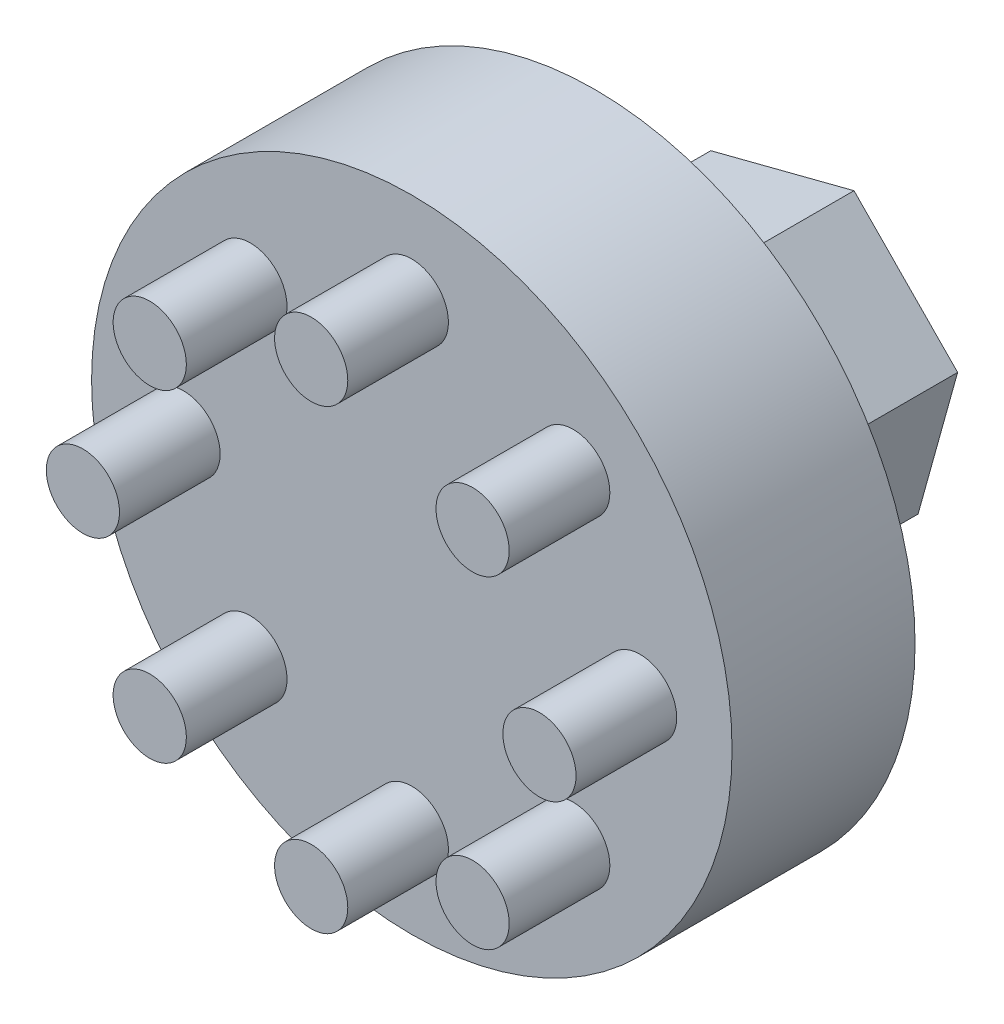
ISO-10303-21;
HEADER;
FILE_DESCRIPTION(('STEP AP214'),'2;1');
FILE_NAME('part.step','',(''),(''),'','','');
FILE_SCHEMA(('AUTOMOTIVE_DESIGN { 1 0 10303 214 1 1 1 1 }'));
ENDSEC;
DATA;
#1=APPLICATION_CONTEXT('core data for automotive mechanical design processes');
#2=APPLICATION_PROTOCOL_DEFINITION('international standard','automotive_design',2000,#1);
#3=PRODUCT_CONTEXT('',#1,'mechanical');
#4=PRODUCT('Part','Part','',(#3));
#5=PRODUCT_RELATED_PRODUCT_CATEGORY('part','',(#4));
#6=PRODUCT_DEFINITION_FORMATION('','',#4);
#7=PRODUCT_DEFINITION_CONTEXT('part definition',#1,'design');
#8=PRODUCT_DEFINITION('design','',#6,#7);
#9=PRODUCT_DEFINITION_SHAPE('','',#8);
#10=(LENGTH_UNIT() NAMED_UNIT(*) SI_UNIT(.MILLI.,.METRE.));
#11=(NAMED_UNIT(*) PLANE_ANGLE_UNIT() SI_UNIT($,.RADIAN.));
#12=(NAMED_UNIT(*) SI_UNIT($,.STERADIAN.) SOLID_ANGLE_UNIT());
#13=UNCERTAINTY_MEASURE_WITH_UNIT(LENGTH_MEASURE(1.E-05),#10,'distance_accuracy_value','');
#14=(GEOMETRIC_REPRESENTATION_CONTEXT(3) GLOBAL_UNCERTAINTY_ASSIGNED_CONTEXT((#13)) GLOBAL_UNIT_ASSIGNED_CONTEXT((#10,
#11,#12)) REPRESENTATION_CONTEXT('',''));
#15=CARTESIAN_POINT('',(0.,0.,0.));
#16=DIRECTION('',(0.,0.,1.));
#17=DIRECTION('',(1.,0.,0.));
#18=AXIS2_PLACEMENT_3D('',#15,#16,#17);
#19=CARTESIAN_POINT('',(0.,0.,0.));
#20=DIRECTION('',(0.,0.,1.));
#21=DIRECTION('',(1.,0.,0.));
#22=AXIS2_PLACEMENT_3D('',#19,#20,#21);
#23=PLANE('',#22);
#24=CARTESIAN_POINT('',(0.,0.,0.));
#25=DIRECTION('',(0.,0.,1.));
#26=DIRECTION('',(1.,0.,0.));
#27=AXIS2_PLACEMENT_3D('',#24,#25,#26);
#28=CIRCLE('',#27,17.5);
#29=CARTESIAN_POINT('',(17.5,0.,0.));
#30=VERTEX_POINT('',#29);
#31=EDGE_CURVE('E48',#30,#30,#28,.T.);
#32=ORIENTED_EDGE('',*,*,#31,.F.);
#33=EDGE_LOOP('',(#32));
#34=FACE_BOUND('',#33,.T.);
#35=DIRECTION('',(0.267671004992272,0.963510369994235,0.));
#36=VECTOR('',#35,1.);
#37=CARTESIAN_POINT('',(-7.82635207746546,-2.02028376543627,0.));
#38=LINE('',#37,#36);
#39=CARTESIAN_POINT('',(-7.82635207746546,-2.02028376543627,0.));
#40=VERTEX_POINT('',#39);
#41=CARTESIAN_POINT('',(-5.66279310245382,5.76767783532808,0.));
#42=VERTEX_POINT('',#41);
#43=EDGE_CURVE('E117',#40,#42,#38,.T.);
#44=ORIENTED_EDGE('',*,*,#43,.F.);
#45=DIRECTION('',(-0.700588954728615,0.713565075176936,0.));
#46=VECTOR('',#45,1.);
#47=CARTESIAN_POINT('',(-2.16355897501164,-7.78796160076434,0.));
#48=LINE('',#47,#46);
#49=CARTESIAN_POINT('',(-2.16355897501165,-7.78796160076434,0.));
#50=VERTEX_POINT('',#49);
#51=EDGE_CURVE('E114',#50,#40,#48,.T.);
#52=ORIENTED_EDGE('',*,*,#51,.F.);
#53=DIRECTION('',(-0.968259959720887,-0.249945294817299,0.));
#54=VECTOR('',#53,1.);
#55=CARTESIAN_POINT('',(5.66279310245382,-5.76767783532807,0.));
#56=LINE('',#55,#54);
#57=CARTESIAN_POINT('',(5.66279310245382,-5.76767783532807,0.));
#58=VERTEX_POINT('',#57);
#59=EDGE_CURVE('E196',#58,#50,#56,.T.);
#60=ORIENTED_EDGE('',*,*,#59,.F.);
#61=DIRECTION('',(-0.267671004992272,-0.963510369994235,0.));
#62=VECTOR('',#61,1.);
#63=CARTESIAN_POINT('',(7.82635207746547,2.02028376543627,0.));
#64=LINE('',#63,#62);
#65=CARTESIAN_POINT('',(7.82635207746547,2.02028376543627,0.));
#66=VERTEX_POINT('',#65);
#67=EDGE_CURVE('E213',#66,#58,#64,.T.);
#68=ORIENTED_EDGE('',*,*,#67,.F.);
#69=DIRECTION('',(0.700588954728615,-0.713565075176936,0.));
#70=VECTOR('',#69,1.);
#71=CARTESIAN_POINT('',(2.16355897501164,7.78796160076434,0.));
#72=LINE('',#71,#70);
#73=CARTESIAN_POINT('',(2.16355897501164,7.78796160076434,0.));
#74=VERTEX_POINT('',#73);
#75=EDGE_CURVE('E64',#74,#66,#72,.T.);
#76=ORIENTED_EDGE('',*,*,#75,.F.);
#77=DIRECTION('',(0.968259959720887,0.249945294817298,0.));
#78=VECTOR('',#77,1.);
#79=CARTESIAN_POINT('',(-5.66279310245382,5.76767783532808,0.));
#80=LINE('',#79,#78);
#81=EDGE_CURVE('E59',#42,#74,#80,.T.);
#82=ORIENTED_EDGE('',*,*,#81,.F.);
#83=EDGE_LOOP('',(#44,#52,#60,#68,#76,#82));
#84=FACE_BOUND('',#83,.T.);
#85=ADVANCED_FACE('F44',(#34,#84),#23,.F.);
#86=CARTESIAN_POINT('',(0.,0.,10.));
#87=DIRECTION('',(0.,0.,-1.));
#88=DIRECTION('',(-1.,0.,0.));
#89=AXIS2_PLACEMENT_3D('',#86,#87,#88);
#90=CYLINDRICAL_SURFACE('',#89,17.5);
#91=CARTESIAN_POINT('',(0.,0.,10.));
#92=DIRECTION('',(0.,0.,1.));
#93=DIRECTION('',(1.,0.,0.));
#94=AXIS2_PLACEMENT_3D('',#91,#92,#93);
#95=CIRCLE('',#94,17.5);
#96=CARTESIAN_POINT('',(17.5,0.,10.));
#97=VERTEX_POINT('',#96);
#98=EDGE_CURVE('E13',#97,#97,#95,.T.);
#99=ORIENTED_EDGE('',*,*,#98,.F.);
#100=EDGE_LOOP('',(#99));
#101=FACE_BOUND('',#100,.T.);
#102=ORIENTED_EDGE('',*,*,#31,.T.);
#103=EDGE_LOOP('',(#102));
#104=FACE_BOUND('',#103,.T.);
#105=ADVANCED_FACE('F46',(#101,#104),#90,.T.);
#106=CARTESIAN_POINT('',(0.,0.,10.));
#107=DIRECTION('',(0.,0.,1.));
#108=DIRECTION('',(1.,0.,0.));
#109=AXIS2_PLACEMENT_3D('',#106,#107,#108);
#110=PLANE('',#109);
#111=CARTESIAN_POINT('',(-8.82115709530209,8.82115709530196,10.));
#112=DIRECTION('',(0.,0.,1.));
#113=DIRECTION('',(1.,0.,0.));
#114=AXIS2_PLACEMENT_3D('',#111,#112,#113);
#115=CIRCLE('',#114,2.);
#116=CARTESIAN_POINT('',(-6.82115709530209,8.82115709530196,10.));
#117=VERTEX_POINT('',#116);
#118=EDGE_CURVE('E118',#117,#117,#115,.T.);
#119=ORIENTED_EDGE('',*,*,#118,.F.);
#120=EDGE_LOOP('',(#119));
#121=FACE_BOUND('',#120,.T.);
#122=CARTESIAN_POINT('',(-12.4749999999997,-3.10857854469547E-13,10.));
#123=DIRECTION('',(0.,0.,1.));
#124=DIRECTION('',(1.,0.,0.));
#125=AXIS2_PLACEMENT_3D('',#122,#123,#124);
#126=CIRCLE('',#125,2.);
#127=CARTESIAN_POINT('',(-10.4749999999997,-3.10857854469547E-13,10.));
#128=VERTEX_POINT('',#127);
#129=EDGE_CURVE('E128',#128,#128,#126,.T.);
#130=ORIENTED_EDGE('',*,*,#129,.F.);
#131=EDGE_LOOP('',(#130));
#132=FACE_BOUND('',#131,.T.);
#133=CARTESIAN_POINT('',(-8.82115709530165,-8.8211570953024,10.));
#134=DIRECTION('',(0.,0.,1.));
#135=DIRECTION('',(1.,0.,0.));
#136=AXIS2_PLACEMENT_3D('',#133,#134,#135);
#137=CIRCLE('',#136,2.);
#138=CARTESIAN_POINT('',(-6.82115709530165,-8.8211570953024,10.));
#139=VERTEX_POINT('',#138);
#140=EDGE_CURVE('E133',#139,#139,#137,.T.);
#141=ORIENTED_EDGE('',*,*,#140,.F.);
#142=EDGE_LOOP('',(#141));
#143=FACE_BOUND('',#142,.T.);
#144=CARTESIAN_POINT('',(6.18660215175221E-13,-12.475,10.));
#145=DIRECTION('',(0.,0.,1.));
#146=DIRECTION('',(1.,0.,0.));
#147=AXIS2_PLACEMENT_3D('',#144,#145,#146);
#148=CIRCLE('',#147,2.);
#149=CARTESIAN_POINT('',(2.00000000000062,-12.475,10.));
#150=VERTEX_POINT('',#149);
#151=EDGE_CURVE('E139',#150,#150,#148,.T.);
#152=ORIENTED_EDGE('',*,*,#151,.F.);
#153=EDGE_LOOP('',(#152));
#154=FACE_BOUND('',#153,.T.);
#155=CARTESIAN_POINT('',(8.82115709530271,-8.82115709530196,10.));
#156=DIRECTION('',(0.,0.,1.));
#157=DIRECTION('',(1.,0.,0.));
#158=AXIS2_PLACEMENT_3D('',#155,#156,#157);
#159=CIRCLE('',#158,2.);
#160=CARTESIAN_POINT('',(10.8211570953027,-8.82115709530196,10.));
#161=VERTEX_POINT('',#160);
#162=EDGE_CURVE('E145',#161,#161,#159,.T.);
#163=ORIENTED_EDGE('',*,*,#162,.F.);
#164=EDGE_LOOP('',(#163));
#165=FACE_BOUND('',#164,.T.);
#166=CARTESIAN_POINT('',(12.4750000000003,3.09330107587611E-13,10.));
#167=DIRECTION('',(0.,0.,1.));
#168=DIRECTION('',(1.,0.,0.));
#169=AXIS2_PLACEMENT_3D('',#166,#167,#168);
#170=CIRCLE('',#169,2.);
#171=CARTESIAN_POINT('',(14.4750000000003,3.09330107587611E-13,10.));
#172=VERTEX_POINT('',#171);
#173=EDGE_CURVE('E151',#172,#172,#170,.T.);
#174=ORIENTED_EDGE('',*,*,#173,.F.);
#175=EDGE_LOOP('',(#174));
#176=FACE_BOUND('',#175,.T.);
#177=CARTESIAN_POINT('',(8.82115709530227,8.8211570953024,10.));
#178=DIRECTION('',(0.,0.,1.));
#179=DIRECTION('',(1.,0.,0.));
#180=AXIS2_PLACEMENT_3D('',#177,#178,#179);
#181=CIRCLE('',#180,2.);
#182=CARTESIAN_POINT('',(10.8211570953023,8.8211570953024,10.));
#183=VERTEX_POINT('',#182);
#184=EDGE_CURVE('E157',#183,#183,#181,.T.);
#185=ORIENTED_EDGE('',*,*,#184,.F.);
#186=EDGE_LOOP('',(#185));
#187=FACE_BOUND('',#186,.T.);
#188=CARTESIAN_POINT('',(0.,12.475,10.));
#189=DIRECTION('',(0.,0.,1.));
#190=DIRECTION('',(1.,0.,0.));
#191=AXIS2_PLACEMENT_3D('',#188,#189,#190);
#192=CIRCLE('',#191,2.);
#193=CARTESIAN_POINT('',(2.,12.475,10.));
#194=VERTEX_POINT('',#193);
#195=EDGE_CURVE('E163',#194,#194,#192,.T.);
#196=ORIENTED_EDGE('',*,*,#195,.F.);
#197=EDGE_LOOP('',(#196));
#198=FACE_BOUND('',#197,.T.);
#199=ORIENTED_EDGE('',*,*,#98,.T.);
#200=EDGE_LOOP('',(#199));
#201=FACE_BOUND('',#200,.T.);
#202=ADVANCED_FACE('F174',(#121,#132,#143,#154,#165,#176,#187,#198,#201),#110,.T.);
#203=CARTESIAN_POINT('',(0.,12.475,15.5));
#204=DIRECTION('',(0.,0.,-1.));
#205=DIRECTION('',(-1.,0.,0.));
#206=AXIS2_PLACEMENT_3D('',#203,#204,#205);
#207=CYLINDRICAL_SURFACE('',#206,2.);
#208=CARTESIAN_POINT('',(0.,12.475,15.5));
#209=DIRECTION('',(0.,0.,1.));
#210=DIRECTION('',(1.,0.,0.));
#211=AXIS2_PLACEMENT_3D('',#208,#209,#210);
#212=CIRCLE('',#211,2.);
#213=CARTESIAN_POINT('',(2.,12.475,15.5));
#214=VERTEX_POINT('',#213);
#215=EDGE_CURVE('E166',#214,#214,#212,.T.);
#216=ORIENTED_EDGE('',*,*,#215,.F.);
#217=EDGE_LOOP('',(#216));
#218=FACE_BOUND('',#217,.T.);
#219=ORIENTED_EDGE('',*,*,#195,.T.);
#220=EDGE_LOOP('',(#219));
#221=FACE_BOUND('',#220,.T.);
#222=ADVANCED_FACE('F172',(#218,#221),#207,.T.);
#223=CARTESIAN_POINT('',(0.,12.475,15.5));
#224=DIRECTION('',(0.,0.,1.));
#225=DIRECTION('',(1.,0.,0.));
#226=AXIS2_PLACEMENT_3D('',#223,#224,#225);
#227=PLANE('',#226);
#228=ORIENTED_EDGE('',*,*,#215,.T.);
#229=EDGE_LOOP('',(#228));
#230=FACE_BOUND('',#229,.T.);
#231=ADVANCED_FACE('F297',(#230),#227,.T.);
#232=CARTESIAN_POINT('',(8.82115709530227,8.8211570953024,15.5));
#233=DIRECTION('',(0.,0.,-1.));
#234=DIRECTION('',(-1.,0.,0.));
#235=AXIS2_PLACEMENT_3D('',#232,#233,#234);
#236=CYLINDRICAL_SURFACE('',#235,2.);
#237=CARTESIAN_POINT('',(8.82115709530227,8.8211570953024,15.5));
#238=DIRECTION('',(0.,0.,1.));
#239=DIRECTION('',(1.,0.,0.));
#240=AXIS2_PLACEMENT_3D('',#237,#238,#239);
#241=CIRCLE('',#240,2.);
#242=CARTESIAN_POINT('',(10.8211570953023,8.8211570953024,15.5));
#243=VERTEX_POINT('',#242);
#244=EDGE_CURVE('E160',#243,#243,#241,.T.);
#245=ORIENTED_EDGE('',*,*,#244,.F.);
#246=EDGE_LOOP('',(#245));
#247=FACE_BOUND('',#246,.T.);
#248=ORIENTED_EDGE('',*,*,#184,.T.);
#249=EDGE_LOOP('',(#248));
#250=FACE_BOUND('',#249,.T.);
#251=ADVANCED_FACE('F293',(#247,#250),#236,.T.);
#252=CARTESIAN_POINT('',(8.82115709530227,8.8211570953024,15.5));
#253=DIRECTION('',(0.,0.,1.));
#254=DIRECTION('',(1.,0.,0.));
#255=AXIS2_PLACEMENT_3D('',#252,#253,#254);
#256=PLANE('',#255);
#257=ORIENTED_EDGE('',*,*,#244,.T.);
#258=EDGE_LOOP('',(#257));
#259=FACE_BOUND('',#258,.T.);
#260=ADVANCED_FACE('F289',(#259),#256,.T.);
#261=CARTESIAN_POINT('',(12.4750000000003,3.09330107587611E-13,15.5));
#262=DIRECTION('',(0.,0.,-1.));
#263=DIRECTION('',(-1.,0.,0.));
#264=AXIS2_PLACEMENT_3D('',#261,#262,#263);
#265=CYLINDRICAL_SURFACE('',#264,2.);
#266=CARTESIAN_POINT('',(12.4750000000003,3.09330107587611E-13,15.5));
#267=DIRECTION('',(0.,0.,1.));
#268=DIRECTION('',(1.,0.,0.));
#269=AXIS2_PLACEMENT_3D('',#266,#267,#268);
#270=CIRCLE('',#269,2.);
#271=CARTESIAN_POINT('',(14.4750000000003,3.09330107587611E-13,15.5));
#272=VERTEX_POINT('',#271);
#273=EDGE_CURVE('E154',#272,#272,#270,.T.);
#274=ORIENTED_EDGE('',*,*,#273,.F.);
#275=EDGE_LOOP('',(#274));
#276=FACE_BOUND('',#275,.T.);
#277=ORIENTED_EDGE('',*,*,#173,.T.);
#278=EDGE_LOOP('',(#277));
#279=FACE_BOUND('',#278,.T.);
#280=ADVANCED_FACE('F285',(#276,#279),#265,.T.);
#281=CARTESIAN_POINT('',(12.4750000000003,3.09330107587611E-13,15.5));
#282=DIRECTION('',(0.,0.,1.));
#283=DIRECTION('',(1.,0.,0.));
#284=AXIS2_PLACEMENT_3D('',#281,#282,#283);
#285=PLANE('',#284);
#286=ORIENTED_EDGE('',*,*,#273,.T.);
#287=EDGE_LOOP('',(#286));
#288=FACE_BOUND('',#287,.T.);
#289=ADVANCED_FACE('F281',(#288),#285,.T.);
#290=CARTESIAN_POINT('',(8.82115709530271,-8.82115709530196,15.5));
#291=DIRECTION('',(0.,0.,-1.));
#292=DIRECTION('',(-1.,0.,0.));
#293=AXIS2_PLACEMENT_3D('',#290,#291,#292);
#294=CYLINDRICAL_SURFACE('',#293,2.);
#295=CARTESIAN_POINT('',(8.82115709530271,-8.82115709530196,15.5));
#296=DIRECTION('',(0.,0.,1.));
#297=DIRECTION('',(1.,0.,0.));
#298=AXIS2_PLACEMENT_3D('',#295,#296,#297);
#299=CIRCLE('',#298,2.);
#300=CARTESIAN_POINT('',(10.8211570953027,-8.82115709530196,15.5));
#301=VERTEX_POINT('',#300);
#302=EDGE_CURVE('E148',#301,#301,#299,.T.);
#303=ORIENTED_EDGE('',*,*,#302,.F.);
#304=EDGE_LOOP('',(#303));
#305=FACE_BOUND('',#304,.T.);
#306=ORIENTED_EDGE('',*,*,#162,.T.);
#307=EDGE_LOOP('',(#306));
#308=FACE_BOUND('',#307,.T.);
#309=ADVANCED_FACE('F277',(#305,#308),#294,.T.);
#310=CARTESIAN_POINT('',(8.82115709530271,-8.82115709530196,15.5));
#311=DIRECTION('',(0.,0.,1.));
#312=DIRECTION('',(1.,0.,0.));
#313=AXIS2_PLACEMENT_3D('',#310,#311,#312);
#314=PLANE('',#313);
#315=ORIENTED_EDGE('',*,*,#302,.T.);
#316=EDGE_LOOP('',(#315));
#317=FACE_BOUND('',#316,.T.);
#318=ADVANCED_FACE('F273',(#317),#314,.T.);
#319=CARTESIAN_POINT('',(6.18660215175221E-13,-12.475,15.5));
#320=DIRECTION('',(0.,0.,-1.));
#321=DIRECTION('',(-1.,0.,0.));
#322=AXIS2_PLACEMENT_3D('',#319,#320,#321);
#323=CYLINDRICAL_SURFACE('',#322,2.);
#324=CARTESIAN_POINT('',(6.18660215175221E-13,-12.475,15.5));
#325=DIRECTION('',(0.,0.,1.));
#326=DIRECTION('',(1.,0.,0.));
#327=AXIS2_PLACEMENT_3D('',#324,#325,#326);
#328=CIRCLE('',#327,2.);
#329=CARTESIAN_POINT('',(2.00000000000062,-12.475,15.5));
#330=VERTEX_POINT('',#329);
#331=EDGE_CURVE('E142',#330,#330,#328,.T.);
#332=ORIENTED_EDGE('',*,*,#331,.F.);
#333=EDGE_LOOP('',(#332));
#334=FACE_BOUND('',#333,.T.);
#335=ORIENTED_EDGE('',*,*,#151,.T.);
#336=EDGE_LOOP('',(#335));
#337=FACE_BOUND('',#336,.T.);
#338=ADVANCED_FACE('F269',(#334,#337),#323,.T.);
#339=CARTESIAN_POINT('',(6.18660215175221E-13,-12.475,15.5));
#340=DIRECTION('',(0.,0.,1.));
#341=DIRECTION('',(1.,0.,0.));
#342=AXIS2_PLACEMENT_3D('',#339,#340,#341);
#343=PLANE('',#342);
#344=ORIENTED_EDGE('',*,*,#331,.T.);
#345=EDGE_LOOP('',(#344));
#346=FACE_BOUND('',#345,.T.);
#347=ADVANCED_FACE('F265',(#346),#343,.T.);
#348=CARTESIAN_POINT('',(-8.82115709530165,-8.8211570953024,15.5));
#349=DIRECTION('',(0.,0.,-1.));
#350=DIRECTION('',(-1.,0.,0.));
#351=AXIS2_PLACEMENT_3D('',#348,#349,#350);
#352=CYLINDRICAL_SURFACE('',#351,2.);
#353=CARTESIAN_POINT('',(-8.82115709530165,-8.8211570953024,15.5));
#354=DIRECTION('',(0.,0.,1.));
#355=DIRECTION('',(1.,0.,0.));
#356=AXIS2_PLACEMENT_3D('',#353,#354,#355);
#357=CIRCLE('',#356,2.);
#358=CARTESIAN_POINT('',(-6.82115709530165,-8.8211570953024,15.5));
#359=VERTEX_POINT('',#358);
#360=EDGE_CURVE('E136',#359,#359,#357,.T.);
#361=ORIENTED_EDGE('',*,*,#360,.F.);
#362=EDGE_LOOP('',(#361));
#363=FACE_BOUND('',#362,.T.);
#364=ORIENTED_EDGE('',*,*,#140,.T.);
#365=EDGE_LOOP('',(#364));
#366=FACE_BOUND('',#365,.T.);
#367=ADVANCED_FACE('F261',(#363,#366),#352,.T.);
#368=CARTESIAN_POINT('',(-8.82115709530165,-8.8211570953024,15.5));
#369=DIRECTION('',(0.,0.,1.));
#370=DIRECTION('',(1.,0.,0.));
#371=AXIS2_PLACEMENT_3D('',#368,#369,#370);
#372=PLANE('',#371);
#373=ORIENTED_EDGE('',*,*,#360,.T.);
#374=EDGE_LOOP('',(#373));
#375=FACE_BOUND('',#374,.T.);
#376=ADVANCED_FACE('F257',(#375),#372,.T.);
#377=CARTESIAN_POINT('',(-12.4749999999997,-3.10857854469547E-13,15.5));
#378=DIRECTION('',(0.,0.,-1.));
#379=DIRECTION('',(-1.,0.,0.));
#380=AXIS2_PLACEMENT_3D('',#377,#378,#379);
#381=CYLINDRICAL_SURFACE('',#380,2.);
#382=CARTESIAN_POINT('',(-12.4749999999997,-3.10857854469547E-13,15.5));
#383=DIRECTION('',(0.,0.,1.));
#384=DIRECTION('',(1.,0.,0.));
#385=AXIS2_PLACEMENT_3D('',#382,#383,#384);
#386=CIRCLE('',#385,2.);
#387=CARTESIAN_POINT('',(-10.4749999999997,-3.10857854469547E-13,15.5));
#388=VERTEX_POINT('',#387);
#389=EDGE_CURVE('E130',#388,#388,#386,.T.);
#390=ORIENTED_EDGE('',*,*,#389,.F.);
#391=EDGE_LOOP('',(#390));
#392=FACE_BOUND('',#391,.T.);
#393=ORIENTED_EDGE('',*,*,#129,.T.);
#394=EDGE_LOOP('',(#393));
#395=FACE_BOUND('',#394,.T.);
#396=ADVANCED_FACE('F253',(#392,#395),#381,.T.);
#397=CARTESIAN_POINT('',(-12.4749999999997,-3.10857854469547E-13,15.5));
#398=DIRECTION('',(0.,0.,1.));
#399=DIRECTION('',(1.,0.,0.));
#400=AXIS2_PLACEMENT_3D('',#397,#398,#399);
#401=PLANE('',#400);
#402=ORIENTED_EDGE('',*,*,#389,.T.);
#403=EDGE_LOOP('',(#402));
#404=FACE_BOUND('',#403,.T.);
#405=ADVANCED_FACE('F249',(#404),#401,.T.);
#406=CARTESIAN_POINT('',(-8.82115709530209,8.82115709530196,15.5));
#407=DIRECTION('',(0.,0.,-1.));
#408=DIRECTION('',(-1.,0.,0.));
#409=AXIS2_PLACEMENT_3D('',#406,#407,#408);
#410=CYLINDRICAL_SURFACE('',#409,2.);
#411=CARTESIAN_POINT('',(-8.82115709530209,8.82115709530196,15.5));
#412=DIRECTION('',(0.,0.,1.));
#413=DIRECTION('',(1.,0.,0.));
#414=AXIS2_PLACEMENT_3D('',#411,#412,#413);
#415=CIRCLE('',#414,2.);
#416=CARTESIAN_POINT('',(-6.82115709530209,8.82115709530196,15.5));
#417=VERTEX_POINT('',#416);
#418=EDGE_CURVE('E121',#417,#417,#415,.T.);
#419=ORIENTED_EDGE('',*,*,#418,.F.);
#420=EDGE_LOOP('',(#419));
#421=FACE_BOUND('',#420,.T.);
#422=ORIENTED_EDGE('',*,*,#118,.T.);
#423=EDGE_LOOP('',(#422));
#424=FACE_BOUND('',#423,.T.);
#425=ADVANCED_FACE('F245',(#421,#424),#410,.T.);
#426=CARTESIAN_POINT('',(-8.82115709530209,8.82115709530196,15.5));
#427=DIRECTION('',(0.,0.,1.));
#428=DIRECTION('',(1.,0.,0.));
#429=AXIS2_PLACEMENT_3D('',#426,#427,#428);
#430=PLANE('',#429);
#431=ORIENTED_EDGE('',*,*,#418,.T.);
#432=EDGE_LOOP('',(#431));
#433=FACE_BOUND('',#432,.T.);
#434=ADVANCED_FACE('F242',(#433),#430,.T.);
#435=CARTESIAN_POINT('',(-7.82635207746546,-2.02028376543627,-12.));
#436=DIRECTION('',(0.963510369994235,-0.267671004992272,0.));
#437=DIRECTION('',(0.267671004992272,0.963510369994235,0.));
#438=AXIS2_PLACEMENT_3D('',#435,#436,#437);
#439=PLANE('',#438);
#440=ORIENTED_EDGE('',*,*,#43,.T.);
#441=DIRECTION('',(0.,0.,1.));
#442=VECTOR('',#441,1.);
#443=CARTESIAN_POINT('',(-5.66279310245382,5.76767783532808,-12.));
#444=LINE('',#443,#442);
#445=CARTESIAN_POINT('',(-5.66279310245382,5.76767783532808,-12.));
#446=VERTEX_POINT('',#445);
#447=EDGE_CURVE('E98',#446,#42,#444,.T.);
#448=ORIENTED_EDGE('',*,*,#447,.F.);
#449=DIRECTION('',(0.267671004992272,0.963510369994235,0.));
#450=VECTOR('',#449,1.);
#451=CARTESIAN_POINT('',(-7.82635207746546,-2.02028376543627,-12.));
#452=LINE('',#451,#450);
#453=CARTESIAN_POINT('',(-7.82635207746546,-2.02028376543627,-12.));
#454=VERTEX_POINT('',#453);
#455=EDGE_CURVE('E105',#454,#446,#452,.T.);
#456=ORIENTED_EDGE('',*,*,#455,.F.);
#457=DIRECTION('',(0.,0.,1.));
#458=VECTOR('',#457,1.);
#459=CARTESIAN_POINT('',(-7.82635207746546,-2.02028376543627,-12.));
#460=LINE('',#459,#458);
#461=EDGE_CURVE('E193',#454,#40,#460,.T.);
#462=ORIENTED_EDGE('',*,*,#461,.T.);
#463=EDGE_LOOP('',(#440,#448,#456,#462));
#464=FACE_BOUND('',#463,.T.);
#465=ADVANCED_FACE('F116',(#464),#439,.F.);
#466=CARTESIAN_POINT('',(-5.66279310245382,5.76767783532808,-12.));
#467=DIRECTION('',(0.249945294817298,-0.968259959720887,0.));
#468=DIRECTION('',(0.968259959720887,0.249945294817298,0.));
#469=AXIS2_PLACEMENT_3D('',#466,#467,#468);
#470=PLANE('',#469);
#471=ORIENTED_EDGE('',*,*,#81,.T.);
#472=DIRECTION('',(0.,0.,1.));
#473=VECTOR('',#472,1.);
#474=CARTESIAN_POINT('',(2.16355897501164,7.78796160076434,-12.));
#475=LINE('',#474,#473);
#476=CARTESIAN_POINT('',(2.16355897501164,7.78796160076434,-12.));
#477=VERTEX_POINT('',#476);
#478=EDGE_CURVE('E101',#477,#74,#475,.T.);
#479=ORIENTED_EDGE('',*,*,#478,.F.);
#480=DIRECTION('',(0.968259959720887,0.249945294817298,0.));
#481=VECTOR('',#480,1.);
#482=CARTESIAN_POINT('',(-5.66279310245382,5.76767783532808,-12.));
#483=LINE('',#482,#481);
#484=EDGE_CURVE('E94',#446,#477,#483,.T.);
#485=ORIENTED_EDGE('',*,*,#484,.F.);
#486=ORIENTED_EDGE('',*,*,#447,.T.);
#487=EDGE_LOOP('',(#471,#479,#485,#486));
#488=FACE_BOUND('',#487,.T.);
#489=ADVANCED_FACE('F96',(#488),#470,.F.);
#490=CARTESIAN_POINT('',(2.16355897501164,7.78796160076434,-12.));
#491=DIRECTION('',(-0.713565075176936,-0.700588954728615,0.));
#492=DIRECTION('',(0.700588954728615,-0.713565075176936,0.));
#493=AXIS2_PLACEMENT_3D('',#490,#491,#492);
#494=PLANE('',#493);
#495=ORIENTED_EDGE('',*,*,#75,.T.);
#496=DIRECTION('',(0.,0.,1.));
#497=VECTOR('',#496,1.);
#498=CARTESIAN_POINT('',(7.82635207746547,2.02028376543627,-12.));
#499=LINE('',#498,#497);
#500=CARTESIAN_POINT('',(7.82635207746547,2.02028376543627,-12.));
#501=VERTEX_POINT('',#500);
#502=EDGE_CURVE('E123',#501,#66,#499,.T.);
#503=ORIENTED_EDGE('',*,*,#502,.F.);
#504=DIRECTION('',(0.700588954728615,-0.713565075176936,0.));
#505=VECTOR('',#504,1.);
#506=CARTESIAN_POINT('',(2.16355897501164,7.78796160076434,-12.));
#507=LINE('',#506,#505);
#508=EDGE_CURVE('E104',#477,#501,#507,.T.);
#509=ORIENTED_EDGE('',*,*,#508,.F.);
#510=ORIENTED_EDGE('',*,*,#478,.T.);
#511=EDGE_LOOP('',(#495,#503,#509,#510));
#512=FACE_BOUND('',#511,.T.);
#513=ADVANCED_FACE('F216',(#512),#494,.F.);
#514=CARTESIAN_POINT('',(7.82635207746547,2.02028376543627,-12.));
#515=DIRECTION('',(-0.963510369994235,0.267671004992272,0.));
#516=DIRECTION('',(-0.267671004992272,-0.963510369994235,0.));
#517=AXIS2_PLACEMENT_3D('',#514,#515,#516);
#518=PLANE('',#517);
#519=ORIENTED_EDGE('',*,*,#67,.T.);
#520=DIRECTION('',(0.,0.,1.));
#521=VECTOR('',#520,1.);
#522=CARTESIAN_POINT('',(5.66279310245382,-5.76767783532807,-12.));
#523=LINE('',#522,#521);
#524=CARTESIAN_POINT('',(5.66279310245382,-5.76767783532807,-12.));
#525=VERTEX_POINT('',#524);
#526=EDGE_CURVE('E199',#525,#58,#523,.T.);
#527=ORIENTED_EDGE('',*,*,#526,.F.);
#528=DIRECTION('',(-0.267671004992272,-0.963510369994235,0.));
#529=VECTOR('',#528,1.);
#530=CARTESIAN_POINT('',(7.82635207746547,2.02028376543627,-12.));
#531=LINE('',#530,#529);
#532=EDGE_CURVE('E214',#501,#525,#531,.T.);
#533=ORIENTED_EDGE('',*,*,#532,.F.);
#534=ORIENTED_EDGE('',*,*,#502,.T.);
#535=EDGE_LOOP('',(#519,#527,#533,#534));
#536=FACE_BOUND('',#535,.T.);
#537=ADVANCED_FACE('F211',(#536),#518,.F.);
#538=CARTESIAN_POINT('',(5.66279310245382,-5.76767783532807,-12.));
#539=DIRECTION('',(-0.249945294817299,0.968259959720887,0.));
#540=DIRECTION('',(-0.968259959720887,-0.249945294817299,0.));
#541=AXIS2_PLACEMENT_3D('',#538,#539,#540);
#542=PLANE('',#541);
#543=ORIENTED_EDGE('',*,*,#59,.T.);
#544=DIRECTION('',(0.,0.,1.));
#545=VECTOR('',#544,1.);
#546=CARTESIAN_POINT('',(-2.16355897501164,-7.78796160076434,-12.));
#547=LINE('',#546,#545);
#548=CARTESIAN_POINT('',(-2.16355897501164,-7.78796160076434,-12.));
#549=VERTEX_POINT('',#548);
#550=EDGE_CURVE('E195',#549,#50,#547,.T.);
#551=ORIENTED_EDGE('',*,*,#550,.F.);
#552=DIRECTION('',(-0.968259959720887,-0.249945294817299,0.));
#553=VECTOR('',#552,1.);
#554=CARTESIAN_POINT('',(5.66279310245382,-5.76767783532807,-12.));
#555=LINE('',#554,#553);
#556=EDGE_CURVE('E201',#525,#549,#555,.T.);
#557=ORIENTED_EDGE('',*,*,#556,.F.);
#558=ORIENTED_EDGE('',*,*,#526,.T.);
#559=EDGE_LOOP('',(#543,#551,#557,#558));
#560=FACE_BOUND('',#559,.T.);
#561=ADVANCED_FACE('F221',(#560),#542,.F.);
#562=CARTESIAN_POINT('',(-2.16355897501164,-7.78796160076434,-12.));
#563=DIRECTION('',(0.713565075176936,0.700588954728615,0.));
#564=DIRECTION('',(-0.700588954728615,0.713565075176936,0.));
#565=AXIS2_PLACEMENT_3D('',#562,#563,#564);
#566=PLANE('',#565);
#567=ORIENTED_EDGE('',*,*,#51,.T.);
#568=ORIENTED_EDGE('',*,*,#461,.F.);
#569=DIRECTION('',(-0.700588954728615,0.713565075176936,0.));
#570=VECTOR('',#569,1.);
#571=CARTESIAN_POINT('',(-2.16355897501164,-7.78796160076434,-12.));
#572=LINE('',#571,#570);
#573=EDGE_CURVE('E110',#549,#454,#572,.T.);
#574=ORIENTED_EDGE('',*,*,#573,.F.);
#575=ORIENTED_EDGE('',*,*,#550,.T.);
#576=EDGE_LOOP('',(#567,#568,#574,#575));
#577=FACE_BOUND('',#576,.T.);
#578=ADVANCED_FACE('F192',(#577),#566,.F.);
#579=CARTESIAN_POINT('',(0.,0.,-12.));
#580=DIRECTION('',(0.,0.,-1.));
#581=DIRECTION('',(-1.,0.,0.));
#582=AXIS2_PLACEMENT_3D('',#579,#580,#581);
#583=PLANE('',#582);
#584=ORIENTED_EDGE('',*,*,#455,.T.);
#585=ORIENTED_EDGE('',*,*,#484,.T.);
#586=ORIENTED_EDGE('',*,*,#508,.T.);
#587=ORIENTED_EDGE('',*,*,#532,.T.);
#588=ORIENTED_EDGE('',*,*,#556,.T.);
#589=ORIENTED_EDGE('',*,*,#573,.T.);
#590=EDGE_LOOP('',(#584,#585,#586,#587,#588,#589));
#591=FACE_BOUND('',#590,.T.);
#592=ADVANCED_FACE('F108',(#591),#583,.T.);
#593=CLOSED_SHELL('',(#85,#105,#202,#222,#231,#251,#260,#280,#289,#309,#318,#338,#347,#367,#376,
#396,#405,#425,#434,#465,#489,#513,#537,#561,#578,#592));
#594=MANIFOLD_SOLID_BREP('B2',#593);
#595=ADVANCED_BREP_SHAPE_REPRESENTATION('',(#18,#594),#14);
#596=SHAPE_DEFINITION_REPRESENTATION(#9,#595);
ENDSEC;
END-ISO-10303-21;
